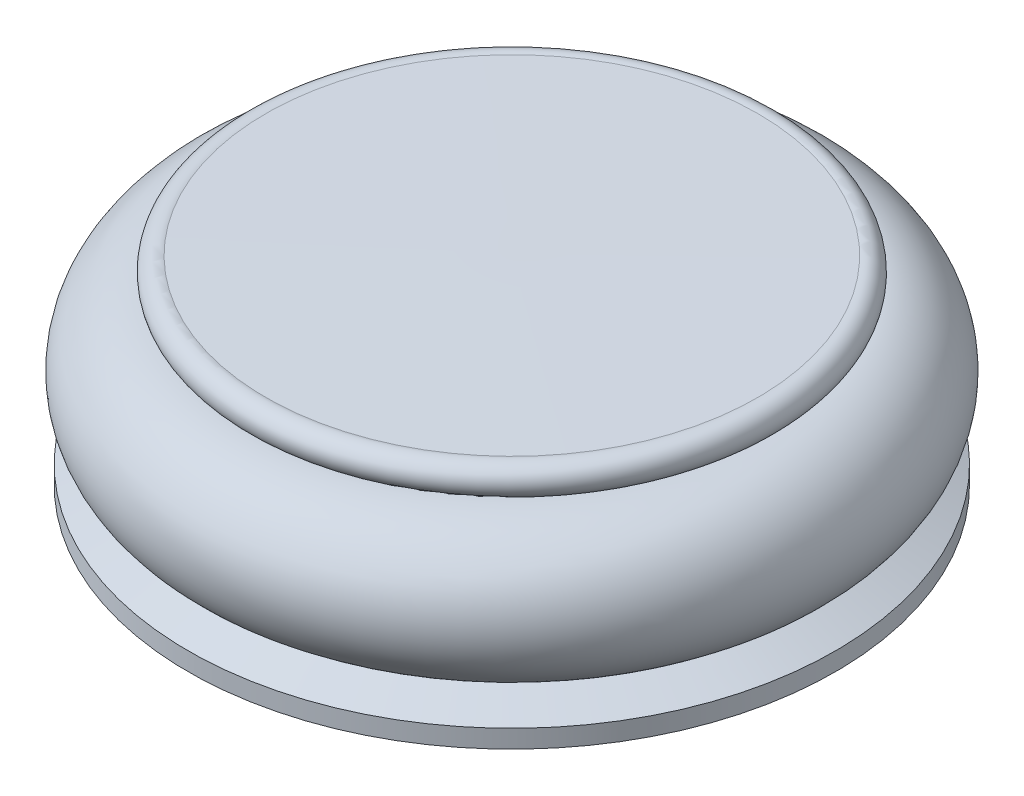
ISO-10303-21;
HEADER;
FILE_DESCRIPTION(('STEP AP214'),'2;1');
FILE_NAME('part.step','',(''),(''),'','','');
FILE_SCHEMA(('AUTOMOTIVE_DESIGN { 1 0 10303 214 1 1 1 1 }'));
ENDSEC;
DATA;
#1=APPLICATION_CONTEXT('core data for automotive mechanical design processes');
#2=APPLICATION_PROTOCOL_DEFINITION('international standard','automotive_design',2000,#1);
#3=PRODUCT_CONTEXT('',#1,'mechanical');
#4=PRODUCT('Part','Part','',(#3));
#5=PRODUCT_RELATED_PRODUCT_CATEGORY('part','',(#4));
#6=PRODUCT_DEFINITION_FORMATION('','',#4);
#7=PRODUCT_DEFINITION_CONTEXT('part definition',#1,'design');
#8=PRODUCT_DEFINITION('design','',#6,#7);
#9=PRODUCT_DEFINITION_SHAPE('','',#8);
#10=(LENGTH_UNIT() NAMED_UNIT(*) SI_UNIT(.MILLI.,.METRE.));
#11=(NAMED_UNIT(*) PLANE_ANGLE_UNIT() SI_UNIT($,.RADIAN.));
#12=(NAMED_UNIT(*) SI_UNIT($,.STERADIAN.) SOLID_ANGLE_UNIT());
#13=UNCERTAINTY_MEASURE_WITH_UNIT(LENGTH_MEASURE(1.E-05),#10,'distance_accuracy_value','');
#14=(GEOMETRIC_REPRESENTATION_CONTEXT(3) GLOBAL_UNCERTAINTY_ASSIGNED_CONTEXT((#13)) GLOBAL_UNIT_ASSIGNED_CONTEXT((#10,
#11,#12)) REPRESENTATION_CONTEXT('',''));
#15=CARTESIAN_POINT('',(0.,0.,0.));
#16=DIRECTION('',(0.,0.,1.));
#17=DIRECTION('',(1.,0.,0.));
#18=AXIS2_PLACEMENT_3D('',#15,#16,#17);
#19=CARTESIAN_POINT('',(0.,-0.0671122124874177,0.));
#20=DIRECTION('',(0.,-1.,0.));
#21=DIRECTION('',(0.,0.,-1.));
#22=AXIS2_PLACEMENT_3D('',#19,#20,#21);
#23=CONICAL_SURFACE('',#22,11.8270294040356,1.56512191017871);
#24=CARTESIAN_POINT('',(0.,0.,0.));
#25=VERTEX_POINT('',#24);
#26=VERTEX_LOOP('',#25);
#27=FACE_BOUND('',#26,.T.);
#28=CARTESIAN_POINT('',(0.,-0.0671122124874177,0.));
#29=DIRECTION('',(0.,-1.,0.));
#30=DIRECTION('',(0.,0.,-1.));
#31=AXIS2_PLACEMENT_3D('',#28,#29,#30);
#32=CIRCLE('',#31,11.8270294040356);
#33=CARTESIAN_POINT('',(0.,-0.0671122124874177,-11.8270294040356));
#34=VERTEX_POINT('',#33);
#35=EDGE_CURVE('E47',#34,#34,#32,.T.);
#36=ORIENTED_EDGE('',*,*,#35,.F.);
#37=EDGE_LOOP('',(#36));
#38=FACE_BOUND('',#37,.T.);
#39=ADVANCED_FACE('F33',(#27,#38),#23,.T.);
#40=CARTESIAN_POINT('',(0.,-9.62189923178285,0.));
#41=DIRECTION('',(0.,-1.,0.));
#42=DIRECTION('',(0.,0.,-1.));
#43=AXIS2_PLACEMENT_3D('',#40,#41,#42);
#44=PLANE('',#43);
#45=CARTESIAN_POINT('',(0.,-9.62189923178285,0.));
#46=DIRECTION('',(0.,-1.,0.));
#47=DIRECTION('',(0.,0.,-1.));
#48=AXIS2_PLACEMENT_3D('',#45,#46,#47);
#49=CIRCLE('',#48,15.5626838299203);
#50=CARTESIAN_POINT('',(0.,-9.62189923178285,-15.5626838299203));
#51=VERTEX_POINT('',#50);
#52=EDGE_CURVE('E11',#51,#51,#49,.T.);
#53=ORIENTED_EDGE('',*,*,#52,.T.);
#54=EDGE_LOOP('',(#53));
#55=FACE_BOUND('',#54,.T.);
#56=ADVANCED_FACE('F44',(#55),#44,.T.);
#57=CARTESIAN_POINT('',(0.,-9.62189923178285,0.));
#58=DIRECTION('',(0.,-1.,0.));
#59=DIRECTION('',(0.,0.,-1.));
#60=AXIS2_PLACEMENT_3D('',#57,#58,#59);
#61=CYLINDRICAL_SURFACE('',#60,15.5626838299203);
#62=CARTESIAN_POINT('',(0.,-8.75150019545093,0.));
#63=DIRECTION('',(0.,-1.,0.));
#64=DIRECTION('',(0.,0.,-1.));
#65=AXIS2_PLACEMENT_3D('',#62,#63,#64);
#66=CIRCLE('',#65,15.5626838299203);
#67=CARTESIAN_POINT('',(0.,-8.75150019545093,-15.5626838299203));
#68=VERTEX_POINT('',#67);
#69=EDGE_CURVE('E39',#68,#68,#66,.T.);
#70=ORIENTED_EDGE('',*,*,#69,.T.);
#71=EDGE_LOOP('',(#70));
#72=FACE_BOUND('',#71,.T.);
#73=ORIENTED_EDGE('',*,*,#52,.F.);
#74=EDGE_LOOP('',(#73));
#75=FACE_BOUND('',#74,.T.);
#76=ADVANCED_FACE('F62',(#72,#75),#61,.T.);
#77=CARTESIAN_POINT('',(0.,-8.75150019545093,0.));
#78=DIRECTION('',(0.,-1.,0.));
#79=DIRECTION('',(0.,0.,-1.));
#80=AXIS2_PLACEMENT_3D('',#77,#78,#79);
#81=CONICAL_SURFACE('',#80,15.5626838299203,1.12819899052598);
#82=CARTESIAN_POINT('',(0.,-7.96056000410056,0.));
#83=DIRECTION('',(0.,-1.,0.));
#84=DIRECTION('',(0.,0.,-1.));
#85=AXIS2_PLACEMENT_3D('',#82,#83,#84);
#86=CIRCLE('',#85,13.8938837061669);
#87=CARTESIAN_POINT('',(0.,-7.96056000410056,-13.8938837061669));
#88=VERTEX_POINT('',#87);
#89=EDGE_CURVE('E57',#88,#88,#86,.T.);
#90=ORIENTED_EDGE('',*,*,#89,.T.);
#91=EDGE_LOOP('',(#90));
#92=FACE_BOUND('',#91,.T.);
#93=ORIENTED_EDGE('',*,*,#69,.F.);
#94=EDGE_LOOP('',(#93));
#95=FACE_BOUND('',#94,.T.);
#96=ADVANCED_FACE('F65',(#92,#95),#81,.T.);
#97=CARTESIAN_POINT('',(0.,-4.86326513623308,0.));
#98=DIRECTION('',(0.,-1.,0.));
#99=DIRECTION('',(0.,0.,-1.));
#100=AXIS2_PLACEMENT_3D('',#97,#98,#99);
#101=TOROIDAL_SURFACE('',#100,12.4225559039821,3.429);
#102=CARTESIAN_POINT('',(0.,-1.43876102688857,0.));
#103=DIRECTION('',(0.,-1.,0.));
#104=DIRECTION('',(0.,0.,-1.));
#105=AXIS2_PLACEMENT_3D('',#102,#103,#104);
#106=CIRCLE('',#105,12.247020707846);
#107=CARTESIAN_POINT('',(0.,-1.43876102688857,-12.247020707846));
#108=VERTEX_POINT('',#107);
#109=EDGE_CURVE('E52',#108,#108,#106,.T.);
#110=ORIENTED_EDGE('',*,*,#109,.T.);
#111=EDGE_LOOP('',(#110));
#112=FACE_BOUND('',#111,.T.);
#113=ORIENTED_EDGE('',*,*,#89,.F.);
#114=EDGE_LOOP('',(#113));
#115=FACE_BOUND('',#114,.T.);
#116=ADVANCED_FACE('F67',(#112,#115),#101,.T.);
#117=CARTESIAN_POINT('',(0.,-9.62189923178285,0.));
#118=DIRECTION('',(0.,-1.,0.));
#119=DIRECTION('',(0.,0.,-1.));
#120=AXIS2_PLACEMENT_3D('',#117,#118,#119);
#121=CYLINDRICAL_SURFACE('',#120,12.247020707846);
#122=CARTESIAN_POINT('',(0.,-1.43241102688857,0.));
#123=DIRECTION('',(0.,-1.,0.));
#124=DIRECTION('',(0.,0.,-1.));
#125=AXIS2_PLACEMENT_3D('',#122,#123,#124);
#126=CIRCLE('',#125,12.247020707846);
#127=CARTESIAN_POINT('',(0.,-1.43241102688857,-12.247020707846));
#128=VERTEX_POINT('',#127);
#129=EDGE_CURVE('E49',#128,#128,#126,.T.);
#130=ORIENTED_EDGE('',*,*,#129,.T.);
#131=EDGE_LOOP('',(#130));
#132=FACE_BOUND('',#131,.T.);
#133=ORIENTED_EDGE('',*,*,#109,.F.);
#134=EDGE_LOOP('',(#133));
#135=FACE_BOUND('',#134,.T.);
#136=ADVANCED_FACE('F74',(#132,#135),#121,.T.);
#137=CARTESIAN_POINT('',(0.,-0.754154793225054,0.));
#138=DIRECTION('',(0.,-1.,0.));
#139=DIRECTION('',(0.,0.,-1.));
#140=AXIS2_PLACEMENT_3D('',#137,#138,#139);
#141=TOROIDAL_SURFACE('',#140,12.0227438206695,0.714375);
#142=ORIENTED_EDGE('',*,*,#35,.T.);
#143=EDGE_LOOP('',(#142));
#144=FACE_BOUND('',#143,.T.);
#145=ORIENTED_EDGE('',*,*,#129,.F.);
#146=EDGE_LOOP('',(#145));
#147=FACE_BOUND('',#146,.T.);
#148=ADVANCED_FACE('F109',(#144,#147),#141,.T.);
#149=CLOSED_SHELL('',(#39,#56,#76,#96,#116,#136,#148));
#150=MANIFOLD_SOLID_BREP('B2',#149);
#151=ADVANCED_BREP_SHAPE_REPRESENTATION('',(#18,#150),#14);
#152=SHAPE_DEFINITION_REPRESENTATION(#9,#151);
ENDSEC;
END-ISO-10303-21;
